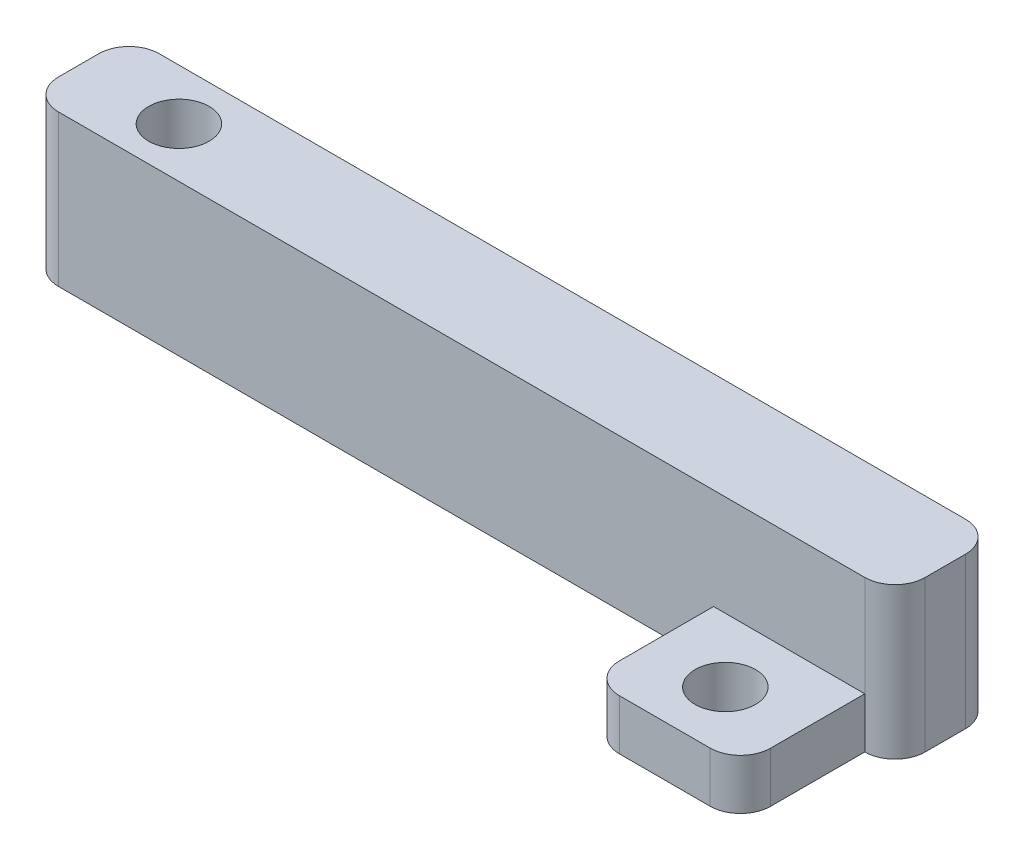
ISO-10303-21;
HEADER;
FILE_DESCRIPTION(('STEP AP214'),'2;1');
FILE_NAME('part.step','',(''),(''),'','','');
FILE_SCHEMA(('AUTOMOTIVE_DESIGN { 1 0 10303 214 1 1 1 1 }'));
ENDSEC;
DATA;
#1=APPLICATION_CONTEXT('core data for automotive mechanical design processes');
#2=APPLICATION_PROTOCOL_DEFINITION('international standard','automotive_design',2000,#1);
#3=PRODUCT_CONTEXT('',#1,'mechanical');
#4=PRODUCT('Part','Part','',(#3));
#5=PRODUCT_RELATED_PRODUCT_CATEGORY('part','',(#4));
#6=PRODUCT_DEFINITION_FORMATION('','',#4);
#7=PRODUCT_DEFINITION_CONTEXT('part definition',#1,'design');
#8=PRODUCT_DEFINITION('design','',#6,#7);
#9=PRODUCT_DEFINITION_SHAPE('','',#8);
#10=(LENGTH_UNIT() NAMED_UNIT(*) SI_UNIT(.MILLI.,.METRE.));
#11=(NAMED_UNIT(*) PLANE_ANGLE_UNIT() SI_UNIT($,.RADIAN.));
#12=(NAMED_UNIT(*) SI_UNIT($,.STERADIAN.) SOLID_ANGLE_UNIT());
#13=UNCERTAINTY_MEASURE_WITH_UNIT(LENGTH_MEASURE(1.E-05),#10,'distance_accuracy_value','');
#14=(GEOMETRIC_REPRESENTATION_CONTEXT(3) GLOBAL_UNCERTAINTY_ASSIGNED_CONTEXT((#13)) GLOBAL_UNIT_ASSIGNED_CONTEXT((#10,
#11,#12)) REPRESENTATION_CONTEXT('',''));
#15=CARTESIAN_POINT('',(0.,0.,0.));
#16=DIRECTION('',(0.,0.,1.));
#17=DIRECTION('',(1.,0.,0.));
#18=AXIS2_PLACEMENT_3D('',#15,#16,#17);
#19=CARTESIAN_POINT('',(-16.2647998533775,15.,6.23801541541571));
#20=DIRECTION('',(0.,-1.,0.));
#21=DIRECTION('',(0.,0.,-1.));
#22=AXIS2_PLACEMENT_3D('',#19,#20,#21);
#23=CYLINDRICAL_SURFACE('',#22,1.4);
#24=CARTESIAN_POINT('',(-16.2647998533775,3.,6.23801541541571));
#25=DIRECTION('',(0.,-1.,0.));
#26=DIRECTION('',(0.,0.,-1.));
#27=AXIS2_PLACEMENT_3D('',#24,#25,#26);
#28=CIRCLE('',#27,1.4);
#29=CARTESIAN_POINT('',(-16.2647998533775,3.,4.8380154154157));
#30=VERTEX_POINT('',#29);
#31=EDGE_CURVE('E198',#30,#30,#28,.T.);
#32=ORIENTED_EDGE('',*,*,#31,.T.);
#33=EDGE_LOOP('',(#32));
#34=FACE_BOUND('',#33,.T.);
#35=CARTESIAN_POINT('',(-16.2647998533775,5.,6.23801541541571));
#36=DIRECTION('',(0.,1.,0.));
#37=DIRECTION('',(0.,0.,1.));
#38=AXIS2_PLACEMENT_3D('',#35,#36,#37);
#39=CIRCLE('',#38,1.4);
#40=CARTESIAN_POINT('',(-16.2647998533775,5.,7.63801541541571));
#41=VERTEX_POINT('',#40);
#42=EDGE_CURVE('E37',#41,#41,#39,.T.);
#43=ORIENTED_EDGE('',*,*,#42,.T.);
#44=EDGE_LOOP('',(#43));
#45=FACE_BOUND('',#44,.T.);
#46=ADVANCED_FACE('F33',(#34,#45),#23,.F.);
#47=CARTESIAN_POINT('',(56.7352001466224,15.,8.18968842461979));
#48=DIRECTION('',(0.,1.,0.));
#49=DIRECTION('',(0.,0.,1.));
#50=AXIS2_PLACEMENT_3D('',#47,#48,#49);
#51=PLANE('',#50);
#52=CARTESIAN_POINT('',(-16.2647998533775,15.,6.23801541541571));
#53=DIRECTION('',(0.,1.,0.));
#54=DIRECTION('',(0.,0.,1.));
#55=AXIS2_PLACEMENT_3D('',#52,#53,#54);
#56=CIRCLE('',#55,3.);
#57=CARTESIAN_POINT('',(-16.2647998533775,15.,9.23801541541571));
#58=VERTEX_POINT('',#57);
#59=EDGE_CURVE('E183',#58,#58,#56,.T.);
#60=ORIENTED_EDGE('',*,*,#59,.F.);
#61=EDGE_LOOP('',(#60));
#62=FACE_BOUND('',#61,.T.);
#63=DIRECTION('',(1.,0.,0.));
#64=VECTOR('',#63,1.);
#65=CARTESIAN_POINT('',(14.2894980552875,15.,11.1896884246198));
#66=LINE('',#65,#64);
#67=CARTESIAN_POINT('',(-23.2647998533775,15.,11.1896884246198));
#68=VERTEX_POINT('',#67);
#69=CARTESIAN_POINT('',(56.7352001466224,15.,11.1896884246198));
#70=VERTEX_POINT('',#69);
#71=EDGE_CURVE('E202',#68,#70,#66,.T.);
#72=ORIENTED_EDGE('',*,*,#71,.T.);
#73=CARTESIAN_POINT('',(56.7352001466224,15.,8.18968842461979));
#74=DIRECTION('',(0.,1.,0.));
#75=DIRECTION('',(0.,0.,1.));
#76=AXIS2_PLACEMENT_3D('',#73,#74,#75);
#77=CIRCLE('',#76,3.);
#78=CARTESIAN_POINT('',(59.7352001466225,15.,8.18968842461979));
#79=VERTEX_POINT('',#78);
#80=EDGE_CURVE('E205',#70,#79,#77,.T.);
#81=ORIENTED_EDGE('',*,*,#80,.T.);
#82=DIRECTION('',(0.,0.,-1.));
#83=VECTOR('',#82,1.);
#84=CARTESIAN_POINT('',(59.7352001466225,15.,4.18968842461978));
#85=LINE('',#84,#83);
#86=CARTESIAN_POINT('',(59.7352001466225,15.,4.18968842461978));
#87=VERTEX_POINT('',#86);
#88=EDGE_CURVE('E208',#79,#87,#85,.T.);
#89=ORIENTED_EDGE('',*,*,#88,.T.);
#90=CARTESIAN_POINT('',(56.7352001466225,15.,4.18968842461978));
#91=DIRECTION('',(0.,1.,0.));
#92=DIRECTION('',(0.,0.,-1.));
#93=AXIS2_PLACEMENT_3D('',#90,#91,#92);
#94=CIRCLE('',#93,3.);
#95=CARTESIAN_POINT('',(56.7352001466225,15.,1.18968842461978));
#96=VERTEX_POINT('',#95);
#97=EDGE_CURVE('E210',#87,#96,#94,.T.);
#98=ORIENTED_EDGE('',*,*,#97,.T.);
#99=DIRECTION('',(-1.,0.,0.));
#100=VECTOR('',#99,1.);
#101=CARTESIAN_POINT('',(56.7352001466225,15.,1.18968842461978));
#102=LINE('',#101,#100);
#103=CARTESIAN_POINT('',(-23.2647998533775,15.,1.18968842461979));
#104=VERTEX_POINT('',#103);
#105=EDGE_CURVE('E212',#96,#104,#102,.T.);
#106=ORIENTED_EDGE('',*,*,#105,.T.);
#107=CARTESIAN_POINT('',(-23.2647998533775,15.,4.18968842461979));
#108=DIRECTION('',(0.,1.,0.));
#109=DIRECTION('',(0.,0.,-1.));
#110=AXIS2_PLACEMENT_3D('',#107,#108,#109);
#111=CIRCLE('',#110,3.);
#112=CARTESIAN_POINT('',(-26.2647998533775,15.,4.18968842461979));
#113=VERTEX_POINT('',#112);
#114=EDGE_CURVE('E214',#104,#113,#111,.T.);
#115=ORIENTED_EDGE('',*,*,#114,.T.);
#116=DIRECTION('',(0.,0.,1.));
#117=VECTOR('',#116,1.);
#118=CARTESIAN_POINT('',(-26.2647998533775,15.,4.18968842461979));
#119=LINE('',#118,#117);
#120=CARTESIAN_POINT('',(-26.2647998533775,15.,8.18968842461979));
#121=VERTEX_POINT('',#120);
#122=EDGE_CURVE('E216',#113,#121,#119,.T.);
#123=ORIENTED_EDGE('',*,*,#122,.T.);
#124=CARTESIAN_POINT('',(-23.2647998533775,15.,8.18968842461979));
#125=DIRECTION('',(0.,1.,0.));
#126=DIRECTION('',(0.,0.,1.));
#127=AXIS2_PLACEMENT_3D('',#124,#125,#126);
#128=CIRCLE('',#127,3.);
#129=EDGE_CURVE('E218',#121,#68,#128,.T.);
#130=ORIENTED_EDGE('',*,*,#129,.T.);
#131=EDGE_LOOP('',(#72,#81,#89,#98,#106,#115,#123,#130));
#132=FACE_BOUND('',#131,.T.);
#133=ADVANCED_FACE('F277',(#62,#132),#51,.T.);
#134=CARTESIAN_POINT('',(56.7352001466224,0.,8.18968842461979));
#135=DIRECTION('',(0.,1.,0.));
#136=DIRECTION('',(0.,0.,1.));
#137=AXIS2_PLACEMENT_3D('',#134,#135,#136);
#138=PLANE('',#137);
#139=CARTESIAN_POINT('',(49.2352001466225,0.,17.5239969621297));
#140=DIRECTION('',(0.,1.,0.));
#141=DIRECTION('',(0.,0.,1.));
#142=AXIS2_PLACEMENT_3D('',#139,#140,#141);
#143=CIRCLE('',#142,3.);
#144=CARTESIAN_POINT('',(49.2352001466225,0.,20.5239969621297));
#145=VERTEX_POINT('',#144);
#146=EDGE_CURVE('E175',#145,#145,#143,.T.);
#147=ORIENTED_EDGE('',*,*,#146,.T.);
#148=EDGE_LOOP('',(#147));
#149=FACE_BOUND('',#148,.T.);
#150=CARTESIAN_POINT('',(-16.2647998533775,0.,6.23801541541571));
#151=DIRECTION('',(0.,-1.,0.));
#152=DIRECTION('',(0.,0.,-1.));
#153=AXIS2_PLACEMENT_3D('',#150,#151,#152);
#154=CIRCLE('',#153,3.);
#155=CARTESIAN_POINT('',(-16.2647998533775,0.,3.2380154154157));
#156=VERTEX_POINT('',#155);
#157=EDGE_CURVE('E199',#156,#156,#154,.T.);
#158=ORIENTED_EDGE('',*,*,#157,.F.);
#159=EDGE_LOOP('',(#158));
#160=FACE_BOUND('',#159,.T.);
#161=CARTESIAN_POINT('',(56.7352001466224,0.,8.18968842461979));
#162=DIRECTION('',(0.,1.,0.));
#163=DIRECTION('',(0.,0.,1.));
#164=AXIS2_PLACEMENT_3D('',#161,#162,#163);
#165=CIRCLE('',#164,3.);
#166=CARTESIAN_POINT('',(56.7352001466224,0.,11.1896884246198));
#167=VERTEX_POINT('',#166);
#168=CARTESIAN_POINT('',(59.7352001466225,0.,8.18968842461979));
#169=VERTEX_POINT('',#168);
#170=EDGE_CURVE('E222',#167,#169,#165,.T.);
#171=ORIENTED_EDGE('',*,*,#170,.F.);
#172=DIRECTION('',(0.,0.,1.));
#173=VECTOR('',#172,1.);
#174=CARTESIAN_POINT('',(56.7352001466224,0.,11.1896884246198));
#175=LINE('',#174,#173);
#176=CARTESIAN_POINT('',(56.7352001466224,0.,20.5239969621297));
#177=VERTEX_POINT('',#176);
#178=EDGE_CURVE('E173',#167,#177,#175,.T.);
#179=ORIENTED_EDGE('',*,*,#178,.T.);
#180=CARTESIAN_POINT('',(53.7352001466224,0.,20.5239969621297));
#181=DIRECTION('',(0.,-1.,0.));
#182=DIRECTION('',(0.,0.,-1.));
#183=AXIS2_PLACEMENT_3D('',#180,#181,#182);
#184=CIRCLE('',#183,3.);
#185=CARTESIAN_POINT('',(53.7352001466224,0.,23.5239969621297));
#186=VERTEX_POINT('',#185);
#187=EDGE_CURVE('E137',#177,#186,#184,.T.);
#188=ORIENTED_EDGE('',*,*,#187,.T.);
#189=DIRECTION('',(-1.,0.,0.));
#190=VECTOR('',#189,1.);
#191=CARTESIAN_POINT('',(53.7352001466224,0.,23.5239969621297));
#192=LINE('',#191,#190);
#193=CARTESIAN_POINT('',(44.7352001466225,0.,23.5239969621297));
#194=VERTEX_POINT('',#193);
#195=EDGE_CURVE('E177',#186,#194,#192,.T.);
#196=ORIENTED_EDGE('',*,*,#195,.T.);
#197=CARTESIAN_POINT('',(44.7352001466225,0.,20.5239969621297));
#198=DIRECTION('',(0.,-1.,0.));
#199=DIRECTION('',(0.,0.,-1.));
#200=AXIS2_PLACEMENT_3D('',#197,#198,#199);
#201=CIRCLE('',#200,3.);
#202=CARTESIAN_POINT('',(41.7352001466225,0.,20.5239969621297));
#203=VERTEX_POINT('',#202);
#204=EDGE_CURVE('E160',#194,#203,#201,.T.);
#205=ORIENTED_EDGE('',*,*,#204,.T.);
#206=DIRECTION('',(0.,0.,-1.));
#207=VECTOR('',#206,1.);
#208=CARTESIAN_POINT('',(41.7352001466225,0.,11.1896884246198));
#209=LINE('',#208,#207);
#210=CARTESIAN_POINT('',(41.7352001466225,0.,11.1896884246198));
#211=VERTEX_POINT('',#210);
#212=EDGE_CURVE('E157',#203,#211,#209,.T.);
#213=ORIENTED_EDGE('',*,*,#212,.T.);
#214=DIRECTION('',(1.,0.,0.));
#215=VECTOR('',#214,1.);
#216=CARTESIAN_POINT('',(-23.2647998533775,0.,11.1896884246198));
#217=LINE('',#216,#215);
#218=CARTESIAN_POINT('',(-23.2647998533775,0.,11.1896884246198));
#219=VERTEX_POINT('',#218);
#220=EDGE_CURVE('E206',#219,#211,#217,.T.);
#221=ORIENTED_EDGE('',*,*,#220,.F.);
#222=CARTESIAN_POINT('',(-23.2647998533775,0.,8.18968842461979));
#223=DIRECTION('',(0.,1.,0.));
#224=DIRECTION('',(0.,0.,1.));
#225=AXIS2_PLACEMENT_3D('',#222,#223,#224);
#226=CIRCLE('',#225,3.);
#227=CARTESIAN_POINT('',(-26.2647998533775,0.,8.18968842461979));
#228=VERTEX_POINT('',#227);
#229=EDGE_CURVE('E234',#228,#219,#226,.T.);
#230=ORIENTED_EDGE('',*,*,#229,.F.);
#231=DIRECTION('',(0.,0.,1.));
#232=VECTOR('',#231,1.);
#233=CARTESIAN_POINT('',(-26.2647998533775,0.,4.18968842461979));
#234=LINE('',#233,#232);
#235=CARTESIAN_POINT('',(-26.2647998533775,0.,4.18968842461979));
#236=VERTEX_POINT('',#235);
#237=EDGE_CURVE('E232',#236,#228,#234,.T.);
#238=ORIENTED_EDGE('',*,*,#237,.F.);
#239=CARTESIAN_POINT('',(-23.2647998533775,0.,4.18968842461979));
#240=DIRECTION('',(0.,1.,0.));
#241=DIRECTION('',(0.,0.,-1.));
#242=AXIS2_PLACEMENT_3D('',#239,#240,#241);
#243=CIRCLE('',#242,3.);
#244=CARTESIAN_POINT('',(-23.2647998533775,0.,1.18968842461979));
#245=VERTEX_POINT('',#244);
#246=EDGE_CURVE('E230',#245,#236,#243,.T.);
#247=ORIENTED_EDGE('',*,*,#246,.F.);
#248=DIRECTION('',(-1.,0.,0.));
#249=VECTOR('',#248,1.);
#250=CARTESIAN_POINT('',(56.7352001466225,0.,1.18968842461978));
#251=LINE('',#250,#249);
#252=CARTESIAN_POINT('',(56.7352001466225,0.,1.18968842461978));
#253=VERTEX_POINT('',#252);
#254=EDGE_CURVE('E228',#253,#245,#251,.T.);
#255=ORIENTED_EDGE('',*,*,#254,.F.);
#256=CARTESIAN_POINT('',(56.7352001466225,0.,4.18968842461978));
#257=DIRECTION('',(0.,1.,0.));
#258=DIRECTION('',(0.,0.,-1.));
#259=AXIS2_PLACEMENT_3D('',#256,#257,#258);
#260=CIRCLE('',#259,3.);
#261=CARTESIAN_POINT('',(59.7352001466225,0.,4.18968842461978));
#262=VERTEX_POINT('',#261);
#263=EDGE_CURVE('E226',#262,#253,#260,.T.);
#264=ORIENTED_EDGE('',*,*,#263,.F.);
#265=DIRECTION('',(0.,0.,-1.));
#266=VECTOR('',#265,1.);
#267=CARTESIAN_POINT('',(59.7352001466225,0.,4.18968842461978));
#268=LINE('',#267,#266);
#269=EDGE_CURVE('E224',#169,#262,#268,.T.);
#270=ORIENTED_EDGE('',*,*,#269,.F.);
#271=EDGE_LOOP('',(#171,#179,#188,#196,#205,#213,#221,#230,#238,#247,#255,#264,#270));
#272=FACE_BOUND('',#271,.T.);
#273=ADVANCED_FACE('F274',(#149,#160,#272),#138,.F.);
#274=CARTESIAN_POINT('',(56.7352001466224,15.,8.18968842461979));
#275=DIRECTION('',(0.,-1.,0.));
#276=DIRECTION('',(0.,0.,-1.));
#277=AXIS2_PLACEMENT_3D('',#274,#275,#276);
#278=CYLINDRICAL_SURFACE('',#277,3.);
#279=ORIENTED_EDGE('',*,*,#170,.T.);
#280=DIRECTION('',(0.,-1.,0.));
#281=VECTOR('',#280,1.);
#282=CARTESIAN_POINT('',(59.7352001466225,15.,8.18968842461979));
#283=LINE('',#282,#281);
#284=EDGE_CURVE('E42',#79,#169,#283,.T.);
#285=ORIENTED_EDGE('',*,*,#284,.F.);
#286=ORIENTED_EDGE('',*,*,#80,.F.);
#287=DIRECTION('',(0.,-1.,0.));
#288=VECTOR('',#287,1.);
#289=CARTESIAN_POINT('',(56.7352001466224,15.,11.1896884246198));
#290=LINE('',#289,#288);
#291=CARTESIAN_POINT('',(56.7352001466224,5.,11.1896884246198));
#292=VERTEX_POINT('',#291);
#293=EDGE_CURVE('E11',#70,#292,#290,.T.);
#294=ORIENTED_EDGE('',*,*,#293,.T.);
#295=DIRECTION('',(0.,-1.,0.));
#296=VECTOR('',#295,1.);
#297=CARTESIAN_POINT('',(56.7352001466224,5.,11.1896884246198));
#298=LINE('',#297,#296);
#299=EDGE_CURVE('E156',#292,#167,#298,.T.);
#300=ORIENTED_EDGE('',*,*,#299,.T.);
#301=EDGE_LOOP('',(#279,#285,#286,#294,#300));
#302=FACE_BOUND('',#301,.T.);
#303=ADVANCED_FACE('F35',(#302),#278,.T.);
#304=CARTESIAN_POINT('',(59.7352001466225,15.,4.18968842461978));
#305=DIRECTION('',(-1.,0.,0.));
#306=DIRECTION('',(0.,0.,1.));
#307=AXIS2_PLACEMENT_3D('',#304,#305,#306);
#308=PLANE('',#307);
#309=ORIENTED_EDGE('',*,*,#269,.T.);
#310=DIRECTION('',(0.,-1.,0.));
#311=VECTOR('',#310,1.);
#312=CARTESIAN_POINT('',(59.7352001466225,15.,4.18968842461978));
#313=LINE('',#312,#311);
#314=EDGE_CURVE('E251',#87,#262,#313,.T.);
#315=ORIENTED_EDGE('',*,*,#314,.F.);
#316=ORIENTED_EDGE('',*,*,#88,.F.);
#317=ORIENTED_EDGE('',*,*,#284,.T.);
#318=EDGE_LOOP('',(#309,#315,#316,#317));
#319=FACE_BOUND('',#318,.T.);
#320=ADVANCED_FACE('F339',(#319),#308,.F.);
#321=CARTESIAN_POINT('',(56.7352001466225,15.,4.18968842461978));
#322=DIRECTION('',(0.,-1.,0.));
#323=DIRECTION('',(0.,0.,-1.));
#324=AXIS2_PLACEMENT_3D('',#321,#322,#323);
#325=CYLINDRICAL_SURFACE('',#324,3.);
#326=ORIENTED_EDGE('',*,*,#263,.T.);
#327=DIRECTION('',(0.,-1.,0.));
#328=VECTOR('',#327,1.);
#329=CARTESIAN_POINT('',(56.7352001466225,15.,1.18968842461978));
#330=LINE('',#329,#328);
#331=EDGE_CURVE('E248',#96,#253,#330,.T.);
#332=ORIENTED_EDGE('',*,*,#331,.F.);
#333=ORIENTED_EDGE('',*,*,#97,.F.);
#334=ORIENTED_EDGE('',*,*,#314,.T.);
#335=EDGE_LOOP('',(#326,#332,#333,#334));
#336=FACE_BOUND('',#335,.T.);
#337=ADVANCED_FACE('F336',(#336),#325,.T.);
#338=CARTESIAN_POINT('',(56.7352001466225,15.,1.18968842461978));
#339=DIRECTION('',(0.,0.,1.));
#340=DIRECTION('',(1.,0.,0.));
#341=AXIS2_PLACEMENT_3D('',#338,#339,#340);
#342=PLANE('',#341);
#343=ORIENTED_EDGE('',*,*,#254,.T.);
#344=DIRECTION('',(0.,-1.,0.));
#345=VECTOR('',#344,1.);
#346=CARTESIAN_POINT('',(-23.2647998533775,15.,1.18968842461979));
#347=LINE('',#346,#345);
#348=EDGE_CURVE('E245',#104,#245,#347,.T.);
#349=ORIENTED_EDGE('',*,*,#348,.F.);
#350=ORIENTED_EDGE('',*,*,#105,.F.);
#351=ORIENTED_EDGE('',*,*,#331,.T.);
#352=EDGE_LOOP('',(#343,#349,#350,#351));
#353=FACE_BOUND('',#352,.T.);
#354=ADVANCED_FACE('F332',(#353),#342,.F.);
#355=CARTESIAN_POINT('',(-23.2647998533775,15.,4.18968842461979));
#356=DIRECTION('',(0.,-1.,0.));
#357=DIRECTION('',(0.,0.,-1.));
#358=AXIS2_PLACEMENT_3D('',#355,#356,#357);
#359=CYLINDRICAL_SURFACE('',#358,3.);
#360=ORIENTED_EDGE('',*,*,#246,.T.);
#361=DIRECTION('',(0.,-1.,0.));
#362=VECTOR('',#361,1.);
#363=CARTESIAN_POINT('',(-26.2647998533775,15.,4.18968842461979));
#364=LINE('',#363,#362);
#365=EDGE_CURVE('E242',#113,#236,#364,.T.);
#366=ORIENTED_EDGE('',*,*,#365,.F.);
#367=ORIENTED_EDGE('',*,*,#114,.F.);
#368=ORIENTED_EDGE('',*,*,#348,.T.);
#369=EDGE_LOOP('',(#360,#366,#367,#368));
#370=FACE_BOUND('',#369,.T.);
#371=ADVANCED_FACE('F328',(#370),#359,.T.);
#372=CARTESIAN_POINT('',(-26.2647998533775,15.,4.18968842461979));
#373=DIRECTION('',(1.,0.,0.));
#374=DIRECTION('',(0.,0.,-1.));
#375=AXIS2_PLACEMENT_3D('',#372,#373,#374);
#376=PLANE('',#375);
#377=ORIENTED_EDGE('',*,*,#237,.T.);
#378=DIRECTION('',(0.,-1.,0.));
#379=VECTOR('',#378,1.);
#380=CARTESIAN_POINT('',(-26.2647998533775,15.,8.18968842461979));
#381=LINE('',#380,#379);
#382=EDGE_CURVE('E239',#121,#228,#381,.T.);
#383=ORIENTED_EDGE('',*,*,#382,.F.);
#384=ORIENTED_EDGE('',*,*,#122,.F.);
#385=ORIENTED_EDGE('',*,*,#365,.T.);
#386=EDGE_LOOP('',(#377,#383,#384,#385));
#387=FACE_BOUND('',#386,.T.);
#388=ADVANCED_FACE('F325',(#387),#376,.F.);
#389=CARTESIAN_POINT('',(-23.2647998533775,15.,8.18968842461979));
#390=DIRECTION('',(0.,-1.,0.));
#391=DIRECTION('',(0.,0.,-1.));
#392=AXIS2_PLACEMENT_3D('',#389,#390,#391);
#393=CYLINDRICAL_SURFACE('',#392,3.);
#394=ORIENTED_EDGE('',*,*,#229,.T.);
#395=DIRECTION('',(0.,-1.,0.));
#396=VECTOR('',#395,1.);
#397=CARTESIAN_POINT('',(-23.2647998533775,15.,11.1896884246198));
#398=LINE('',#397,#396);
#399=EDGE_CURVE('E221',#68,#219,#398,.T.);
#400=ORIENTED_EDGE('',*,*,#399,.F.);
#401=ORIENTED_EDGE('',*,*,#129,.F.);
#402=ORIENTED_EDGE('',*,*,#382,.T.);
#403=EDGE_LOOP('',(#394,#400,#401,#402));
#404=FACE_BOUND('',#403,.T.);
#405=ADVANCED_FACE('F291',(#404),#393,.T.);
#406=CARTESIAN_POINT('',(-23.2647998533775,15.,11.1896884246198));
#407=DIRECTION('',(0.,0.,-1.));
#408=DIRECTION('',(-1.,0.,0.));
#409=AXIS2_PLACEMENT_3D('',#406,#407,#408);
#410=PLANE('',#409);
#411=ORIENTED_EDGE('',*,*,#220,.T.);
#412=DIRECTION('',(0.,-1.,0.));
#413=VECTOR('',#412,1.);
#414=CARTESIAN_POINT('',(41.7352001466225,5.,11.1896884246198));
#415=LINE('',#414,#413);
#416=CARTESIAN_POINT('',(41.7352001466225,5.,11.1896884246198));
#417=VERTEX_POINT('',#416);
#418=EDGE_CURVE('E50',#417,#211,#415,.T.);
#419=ORIENTED_EDGE('',*,*,#418,.F.);
#420=DIRECTION('',(1.,0.,0.));
#421=VECTOR('',#420,1.);
#422=CARTESIAN_POINT('',(56.7352001466224,5.,11.1896884246198));
#423=LINE('',#422,#421);
#424=EDGE_CURVE('E55',#417,#292,#423,.T.);
#425=ORIENTED_EDGE('',*,*,#424,.T.);
#426=ORIENTED_EDGE('',*,*,#293,.F.);
#427=ORIENTED_EDGE('',*,*,#71,.F.);
#428=ORIENTED_EDGE('',*,*,#399,.T.);
#429=EDGE_LOOP('',(#411,#419,#425,#426,#427,#428));
#430=FACE_BOUND('',#429,.T.);
#431=ADVANCED_FACE('F270',(#430),#410,.F.);
#432=CARTESIAN_POINT('',(-16.2647998533775,3.,6.23801541541571));
#433=DIRECTION('',(0.,-1.,0.));
#434=DIRECTION('',(0.,0.,-1.));
#435=AXIS2_PLACEMENT_3D('',#432,#433,#434);
#436=CYLINDRICAL_SURFACE('',#435,3.);
#437=CARTESIAN_POINT('',(-16.2647998533775,3.,6.23801541541571));
#438=DIRECTION('',(0.,-1.,0.));
#439=DIRECTION('',(0.,0.,-1.));
#440=AXIS2_PLACEMENT_3D('',#437,#438,#439);
#441=CIRCLE('',#440,3.);
#442=CARTESIAN_POINT('',(-16.2647998533775,3.,3.2380154154157));
#443=VERTEX_POINT('',#442);
#444=EDGE_CURVE('E195',#443,#443,#441,.T.);
#445=ORIENTED_EDGE('',*,*,#444,.F.);
#446=EDGE_LOOP('',(#445));
#447=FACE_BOUND('',#446,.T.);
#448=ORIENTED_EDGE('',*,*,#157,.T.);
#449=EDGE_LOOP('',(#448));
#450=FACE_BOUND('',#449,.T.);
#451=ADVANCED_FACE('F264',(#447,#450),#436,.F.);
#452=CARTESIAN_POINT('',(-16.2647998533775,3.,6.23801541541571));
#453=DIRECTION('',(0.,-1.,0.));
#454=DIRECTION('',(0.,0.,-1.));
#455=AXIS2_PLACEMENT_3D('',#452,#453,#454);
#456=PLANE('',#455);
#457=ORIENTED_EDGE('',*,*,#31,.F.);
#458=EDGE_LOOP('',(#457));
#459=FACE_BOUND('',#458,.T.);
#460=ORIENTED_EDGE('',*,*,#444,.T.);
#461=EDGE_LOOP('',(#460));
#462=FACE_BOUND('',#461,.T.);
#463=ADVANCED_FACE('F260',(#459,#462),#456,.T.);
#464=CARTESIAN_POINT('',(-16.2647998533775,5.,6.23801541541571));
#465=DIRECTION('',(0.,1.,0.));
#466=DIRECTION('',(0.,0.,1.));
#467=AXIS2_PLACEMENT_3D('',#464,#465,#466);
#468=CYLINDRICAL_SURFACE('',#467,3.);
#469=CARTESIAN_POINT('',(-16.2647998533775,5.,6.23801541541571));
#470=DIRECTION('',(0.,1.,0.));
#471=DIRECTION('',(0.,0.,1.));
#472=AXIS2_PLACEMENT_3D('',#469,#470,#471);
#473=CIRCLE('',#472,3.);
#474=CARTESIAN_POINT('',(-16.2647998533775,5.,9.23801541541571));
#475=VERTEX_POINT('',#474);
#476=EDGE_CURVE('E190',#475,#475,#473,.T.);
#477=ORIENTED_EDGE('',*,*,#476,.F.);
#478=EDGE_LOOP('',(#477));
#479=FACE_BOUND('',#478,.T.);
#480=ORIENTED_EDGE('',*,*,#59,.T.);
#481=EDGE_LOOP('',(#480));
#482=FACE_BOUND('',#481,.T.);
#483=ADVANCED_FACE('F263',(#479,#482),#468,.F.);
#484=CARTESIAN_POINT('',(-16.2647998533775,5.,6.23801541541571));
#485=DIRECTION('',(0.,1.,0.));
#486=DIRECTION('',(0.,0.,1.));
#487=AXIS2_PLACEMENT_3D('',#484,#485,#486);
#488=PLANE('',#487);
#489=ORIENTED_EDGE('',*,*,#42,.F.);
#490=EDGE_LOOP('',(#489));
#491=FACE_BOUND('',#490,.T.);
#492=ORIENTED_EDGE('',*,*,#476,.T.);
#493=EDGE_LOOP('',(#492));
#494=FACE_BOUND('',#493,.T.);
#495=ADVANCED_FACE('F381',(#491,#494),#488,.T.);
#496=CARTESIAN_POINT('',(56.7352001466224,5.,11.1896884246198));
#497=DIRECTION('',(1.,0.,0.));
#498=DIRECTION('',(0.,0.,-1.));
#499=AXIS2_PLACEMENT_3D('',#496,#497,#498);
#500=PLANE('',#499);
#501=ORIENTED_EDGE('',*,*,#178,.F.);
#502=ORIENTED_EDGE('',*,*,#299,.F.);
#503=DIRECTION('',(0.,0.,1.));
#504=VECTOR('',#503,1.);
#505=CARTESIAN_POINT('',(56.7352001466224,5.,11.1896884246198));
#506=LINE('',#505,#504);
#507=CARTESIAN_POINT('',(56.7352001466224,5.,20.5239969621297));
#508=VERTEX_POINT('',#507);
#509=EDGE_CURVE('E148',#292,#508,#506,.T.);
#510=ORIENTED_EDGE('',*,*,#509,.T.);
#511=DIRECTION('',(0.,-1.,0.));
#512=VECTOR('',#511,1.);
#513=CARTESIAN_POINT('',(56.7352001466224,5.,20.5239969621297));
#514=LINE('',#513,#512);
#515=EDGE_CURVE('E132',#508,#177,#514,.T.);
#516=ORIENTED_EDGE('',*,*,#515,.T.);
#517=EDGE_LOOP('',(#501,#502,#510,#516));
#518=FACE_BOUND('',#517,.T.);
#519=ADVANCED_FACE('F154',(#518),#500,.T.);
#520=CARTESIAN_POINT('',(41.7352001466225,5.,11.1896884246198));
#521=DIRECTION('',(-1.,0.,0.));
#522=DIRECTION('',(0.,0.,1.));
#523=AXIS2_PLACEMENT_3D('',#520,#521,#522);
#524=PLANE('',#523);
#525=ORIENTED_EDGE('',*,*,#212,.F.);
#526=DIRECTION('',(0.,-1.,0.));
#527=VECTOR('',#526,1.);
#528=CARTESIAN_POINT('',(41.7352001466225,5.,20.5239969621297));
#529=LINE('',#528,#527);
#530=CARTESIAN_POINT('',(41.7352001466225,5.,20.5239969621297));
#531=VERTEX_POINT('',#530);
#532=EDGE_CURVE('E185',#531,#203,#529,.T.);
#533=ORIENTED_EDGE('',*,*,#532,.F.);
#534=DIRECTION('',(0.,0.,-1.));
#535=VECTOR('',#534,1.);
#536=CARTESIAN_POINT('',(41.7352001466225,5.,11.1896884246198));
#537=LINE('',#536,#535);
#538=EDGE_CURVE('E170',#531,#417,#537,.T.);
#539=ORIENTED_EDGE('',*,*,#538,.T.);
#540=ORIENTED_EDGE('',*,*,#418,.T.);
#541=EDGE_LOOP('',(#525,#533,#539,#540));
#542=FACE_BOUND('',#541,.T.);
#543=ADVANCED_FACE('F297',(#542),#524,.T.);
#544=CARTESIAN_POINT('',(44.7352001466225,5.,20.5239969621297));
#545=DIRECTION('',(0.,-1.,0.));
#546=DIRECTION('',(0.,0.,-1.));
#547=AXIS2_PLACEMENT_3D('',#544,#545,#546);
#548=CYLINDRICAL_SURFACE('',#547,3.);
#549=ORIENTED_EDGE('',*,*,#204,.F.);
#550=DIRECTION('',(0.,-1.,0.));
#551=VECTOR('',#550,1.);
#552=CARTESIAN_POINT('',(44.7352001466225,5.,23.5239969621297));
#553=LINE('',#552,#551);
#554=CARTESIAN_POINT('',(44.7352001466225,5.,23.5239969621297));
#555=VERTEX_POINT('',#554);
#556=EDGE_CURVE('E187',#555,#194,#553,.T.);
#557=ORIENTED_EDGE('',*,*,#556,.F.);
#558=CARTESIAN_POINT('',(44.7352001466225,5.,20.5239969621297));
#559=DIRECTION('',(0.,-1.,0.));
#560=DIRECTION('',(0.,0.,-1.));
#561=AXIS2_PLACEMENT_3D('',#558,#559,#560);
#562=CIRCLE('',#561,3.);
#563=EDGE_CURVE('E167',#555,#531,#562,.T.);
#564=ORIENTED_EDGE('',*,*,#563,.T.);
#565=ORIENTED_EDGE('',*,*,#532,.T.);
#566=EDGE_LOOP('',(#549,#557,#564,#565));
#567=FACE_BOUND('',#566,.T.);
#568=ADVANCED_FACE('F301',(#567),#548,.T.);
#569=CARTESIAN_POINT('',(53.7352001466224,5.,23.5239969621297));
#570=DIRECTION('',(0.,0.,1.));
#571=DIRECTION('',(1.,0.,0.));
#572=AXIS2_PLACEMENT_3D('',#569,#570,#571);
#573=PLANE('',#572);
#574=ORIENTED_EDGE('',*,*,#195,.F.);
#575=DIRECTION('',(0.,-1.,0.));
#576=VECTOR('',#575,1.);
#577=CARTESIAN_POINT('',(53.7352001466224,5.,23.5239969621297));
#578=LINE('',#577,#576);
#579=CARTESIAN_POINT('',(53.7352001466224,5.,23.5239969621297));
#580=VERTEX_POINT('',#579);
#581=EDGE_CURVE('E142',#580,#186,#578,.T.);
#582=ORIENTED_EDGE('',*,*,#581,.F.);
#583=DIRECTION('',(-1.,0.,0.));
#584=VECTOR('',#583,1.);
#585=CARTESIAN_POINT('',(53.7352001466224,5.,23.5239969621297));
#586=LINE('',#585,#584);
#587=EDGE_CURVE('E151',#580,#555,#586,.T.);
#588=ORIENTED_EDGE('',*,*,#587,.T.);
#589=ORIENTED_EDGE('',*,*,#556,.T.);
#590=EDGE_LOOP('',(#574,#582,#588,#589));
#591=FACE_BOUND('',#590,.T.);
#592=ADVANCED_FACE('F304',(#591),#573,.T.);
#593=CARTESIAN_POINT('',(53.7352001466224,5.,20.5239969621297));
#594=DIRECTION('',(0.,-1.,0.));
#595=DIRECTION('',(0.,0.,-1.));
#596=AXIS2_PLACEMENT_3D('',#593,#594,#595);
#597=CYLINDRICAL_SURFACE('',#596,3.);
#598=ORIENTED_EDGE('',*,*,#187,.F.);
#599=ORIENTED_EDGE('',*,*,#515,.F.);
#600=CARTESIAN_POINT('',(53.7352001466224,5.,20.5239969621297));
#601=DIRECTION('',(0.,-1.,0.));
#602=DIRECTION('',(0.,0.,-1.));
#603=AXIS2_PLACEMENT_3D('',#600,#601,#602);
#604=CIRCLE('',#603,3.);
#605=EDGE_CURVE('E135',#508,#580,#604,.T.);
#606=ORIENTED_EDGE('',*,*,#605,.T.);
#607=ORIENTED_EDGE('',*,*,#581,.T.);
#608=EDGE_LOOP('',(#598,#599,#606,#607));
#609=FACE_BOUND('',#608,.T.);
#610=ADVANCED_FACE('F134',(#609),#597,.T.);
#611=CARTESIAN_POINT('',(53.7352001466224,5.,20.5239969621297));
#612=DIRECTION('',(0.,-1.,0.));
#613=DIRECTION('',(0.,0.,-1.));
#614=AXIS2_PLACEMENT_3D('',#611,#612,#613);
#615=PLANE('',#614);
#616=CARTESIAN_POINT('',(49.2352001466225,5.,17.5239969621297));
#617=DIRECTION('',(0.,1.,0.));
#618=DIRECTION('',(0.,0.,1.));
#619=AXIS2_PLACEMENT_3D('',#616,#617,#618);
#620=CIRCLE('',#619,3.);
#621=CARTESIAN_POINT('',(49.2352001466225,5.,20.5239969621297));
#622=VERTEX_POINT('',#621);
#623=EDGE_CURVE('E163',#622,#622,#620,.T.);
#624=ORIENTED_EDGE('',*,*,#623,.F.);
#625=EDGE_LOOP('',(#624));
#626=FACE_BOUND('',#625,.T.);
#627=ORIENTED_EDGE('',*,*,#509,.F.);
#628=ORIENTED_EDGE('',*,*,#424,.F.);
#629=ORIENTED_EDGE('',*,*,#538,.F.);
#630=ORIENTED_EDGE('',*,*,#563,.F.);
#631=ORIENTED_EDGE('',*,*,#587,.F.);
#632=ORIENTED_EDGE('',*,*,#605,.F.);
#633=EDGE_LOOP('',(#627,#628,#629,#630,#631,#632));
#634=FACE_BOUND('',#633,.T.);
#635=ADVANCED_FACE('F147',(#626,#634),#615,.F.);
#636=CARTESIAN_POINT('',(49.2352001466225,0.,17.5239969621297));
#637=DIRECTION('',(0.,1.,0.));
#638=DIRECTION('',(0.,0.,1.));
#639=AXIS2_PLACEMENT_3D('',#636,#637,#638);
#640=CYLINDRICAL_SURFACE('',#639,3.);
#641=ORIENTED_EDGE('',*,*,#146,.F.);
#642=EDGE_LOOP('',(#641));
#643=FACE_BOUND('',#642,.T.);
#644=ORIENTED_EDGE('',*,*,#623,.T.);
#645=EDGE_LOOP('',(#644));
#646=FACE_BOUND('',#645,.T.);
#647=ADVANCED_FACE('F426',(#643,#646),#640,.F.);
#648=CLOSED_SHELL('',(#46,#133,#273,#303,#320,#337,#354,#371,#388,#405,#431,#451,#463,#483,#495,
#519,#543,#568,#592,#610,#635,#647));
#649=MANIFOLD_SOLID_BREP('B2',#648);
#650=ADVANCED_BREP_SHAPE_REPRESENTATION('',(#18,#649),#14);
#651=SHAPE_DEFINITION_REPRESENTATION(#9,#650);
ENDSEC;
END-ISO-10303-21;
